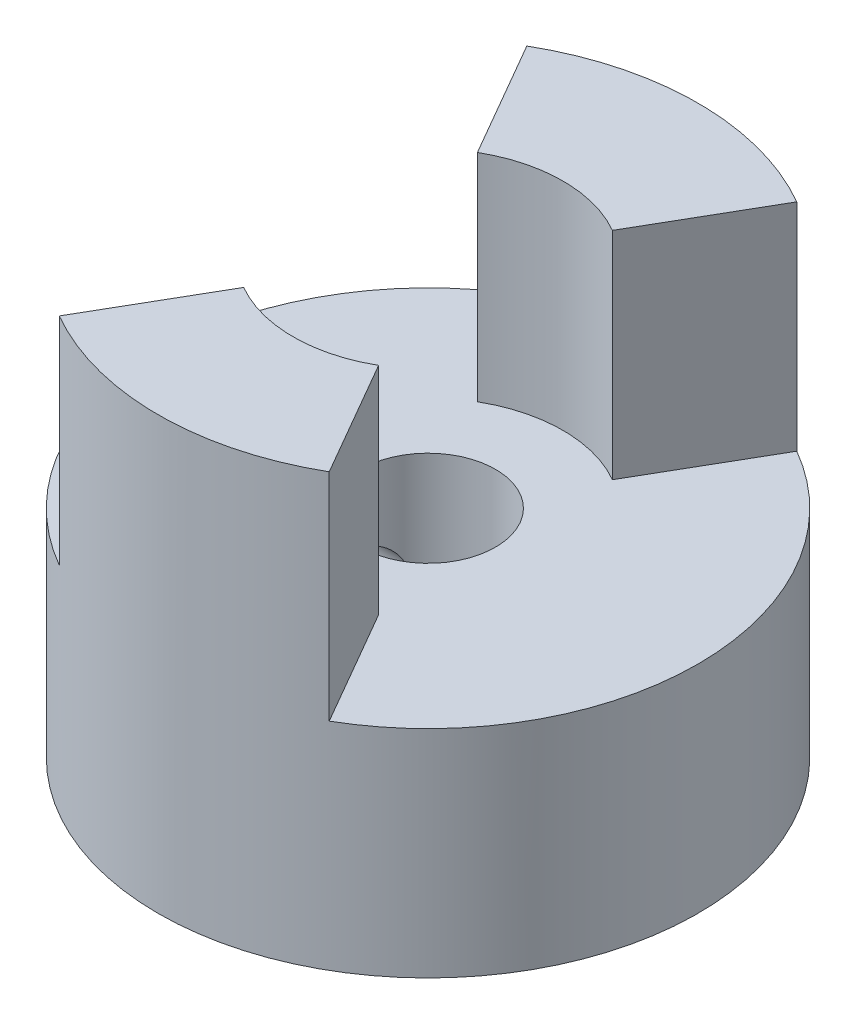
ISO-10303-21;
HEADER;
FILE_DESCRIPTION(('STEP AP214'),'2;1');
FILE_NAME('part.step','',(''),(''),'','','');
FILE_SCHEMA(('AUTOMOTIVE_DESIGN { 1 0 10303 214 1 1 1 1 }'));
ENDSEC;
DATA;
#1=APPLICATION_CONTEXT('core data for automotive mechanical design processes');
#2=APPLICATION_PROTOCOL_DEFINITION('international standard','automotive_design',2000,#1);
#3=PRODUCT_CONTEXT('',#1,'mechanical');
#4=PRODUCT('Part','Part','',(#3));
#5=PRODUCT_RELATED_PRODUCT_CATEGORY('part','',(#4));
#6=PRODUCT_DEFINITION_FORMATION('','',#4);
#7=PRODUCT_DEFINITION_CONTEXT('part definition',#1,'design');
#8=PRODUCT_DEFINITION('design','',#6,#7);
#9=PRODUCT_DEFINITION_SHAPE('','',#8);
#10=(LENGTH_UNIT() NAMED_UNIT(*) SI_UNIT(.MILLI.,.METRE.));
#11=(NAMED_UNIT(*) PLANE_ANGLE_UNIT() SI_UNIT($,.RADIAN.));
#12=(NAMED_UNIT(*) SI_UNIT($,.STERADIAN.) SOLID_ANGLE_UNIT());
#13=UNCERTAINTY_MEASURE_WITH_UNIT(LENGTH_MEASURE(1.E-05),#10,'distance_accuracy_value','');
#14=(GEOMETRIC_REPRESENTATION_CONTEXT(3) GLOBAL_UNCERTAINTY_ASSIGNED_CONTEXT((#13)) GLOBAL_UNIT_ASSIGNED_CONTEXT((#10,
#11,#12)) REPRESENTATION_CONTEXT('',''));
#15=CARTESIAN_POINT('',(0.,0.,0.));
#16=DIRECTION('',(0.,0.,1.));
#17=DIRECTION('',(1.,0.,0.));
#18=AXIS2_PLACEMENT_3D('',#15,#16,#17);
#19=CARTESIAN_POINT('',(0.,10.16,0.));
#20=DIRECTION('',(0.,-1.,0.));
#21=DIRECTION('',(0.,0.,-1.));
#22=AXIS2_PLACEMENT_3D('',#19,#20,#21);
#23=CYLINDRICAL_SURFACE('',#22,6.35);
#24=CARTESIAN_POINT('',(-6.28558851935748,2.54,0.902151298464642));
#25=CARTESIAN_POINT('',(-6.28558930949851,2.49032772069293,0.90214922151933));
#26=CARTESIAN_POINT('',(-6.28619225287237,2.44062567311102,0.897975378967087));
#27=CARTESIAN_POINT('',(-6.28853827720004,2.34260849163608,0.881393080700006));
#28=CARTESIAN_POINT('',(-6.2902825036285,2.29429480211196,0.868976351642361));
#29=CARTESIAN_POINT('',(-6.29471196337785,2.20048744729698,0.836284410783646));
#30=CARTESIAN_POINT('',(-6.29739650963554,2.15499175146994,0.816014935602378));
#31=CARTESIAN_POINT('',(-6.30340687039908,2.06805561150595,0.768205433808864));
#32=CARTESIAN_POINT('',(-6.30673258764374,2.02661455374414,0.740666509687786));
#33=CARTESIAN_POINT('',(-6.31368140709518,1.94866713173239,0.678893494066909));
#34=CARTESIAN_POINT('',(-6.31730623736015,1.91219321346583,0.644618650565194));
#35=CARTESIAN_POINT('',(-6.32443601084304,1.84549623151414,0.570433994980236));
#36=CARTESIAN_POINT('',(-6.32794094773124,1.81527349743435,0.53052388595371));
#37=CARTESIAN_POINT('',(-6.33446054188011,1.76181837511808,0.445994687258361));
#38=CARTESIAN_POINT('',(-6.33747309348638,1.73861566552863,0.401356653100046));
#39=CARTESIAN_POINT('',(-6.34265794372639,1.7000495318179,0.308767899262933));
#40=CARTESIAN_POINT('',(-6.34483028116611,1.68468574563916,0.260817332696702));
#41=CARTESIAN_POINT('',(-6.34808611517873,1.66233138741441,0.163297596386096));
#42=CARTESIAN_POINT('',(-6.34917665164524,1.65528662083121,0.113741088201795));
#43=CARTESIAN_POINT('',(-6.35017951352969,1.64960213401485,0.0141377220658727));
#44=CARTESIAN_POINT('',(-6.35009189638939,1.65096200400566,-0.0359091118606696));
#45=CARTESIAN_POINT('',(-6.34876205070392,1.66200514148729,-0.134703124233849));
#46=CARTESIAN_POINT('',(-6.34752790394927,1.6716301130808,-0.18345694549462));
#47=CARTESIAN_POINT('',(-6.34406201633724,1.69883888925252,-0.27865266882191));
#48=CARTESIAN_POINT('',(-6.34183025255263,1.71642287674484,-0.325094517727449));
#49=CARTESIAN_POINT('',(-6.3366145220809,1.75911119014937,-0.414525745346832));
#50=CARTESIAN_POINT('',(-6.33362807708654,1.78424034592336,-0.457503121429912));
#51=CARTESIAN_POINT('',(-6.32724357962926,1.84128757267097,-0.538653941166115));
#52=CARTESIAN_POINT('',(-6.32384550352816,1.87320603360462,-0.576827108677446));
#53=CARTESIAN_POINT('',(-6.31698945662908,1.94325132515958,-0.647628545434086));
#54=CARTESIAN_POINT('',(-6.31353122210508,1.98142901671788,-0.680206491871437));
#55=CARTESIAN_POINT('',(-6.3069787639118,2.0627354418289,-0.738499853663496));
#56=CARTESIAN_POINT('',(-6.30388454197191,2.10586419890154,-0.764215236415832));
#57=CARTESIAN_POINT('',(-6.29841511394585,2.19589772373991,-0.808058081331826));
#58=CARTESIAN_POINT('',(-6.29604035262133,2.24280480463289,-0.826180852476162));
#59=CARTESIAN_POINT('',(-6.29229021334769,2.33903717874309,-0.854275504100272));
#60=CARTESIAN_POINT('',(-6.29091477444326,2.38836232427056,-0.864247881731272));
#61=CARTESIAN_POINT('',(-6.28933223560538,2.48758431928694,-0.875690381369412));
#62=CARTESIAN_POINT('',(-6.28911536044955,2.53747281475086,-0.877231642427657));
#63=CARTESIAN_POINT('',(-6.28984886834818,2.6367960708403,-0.871956436711648));
#64=CARTESIAN_POINT('',(-6.29079921999532,2.68623084363837,-0.865140194818015));
#65=CARTESIAN_POINT('',(-6.29374993544121,2.78302609918136,-0.843403796466012));
#66=CARTESIAN_POINT('',(-6.29574576034953,2.83039459708842,-0.82851866120804));
#67=CARTESIAN_POINT('',(-6.30055622166778,2.92196459745703,-0.791103634503589));
#68=CARTESIAN_POINT('',(-6.30337089366738,2.96616596216093,-0.768573410770463));
#69=CARTESIAN_POINT('',(-6.30952112311314,3.05046703466814,-0.716335666814462));
#70=CARTESIAN_POINT('',(-6.31285998938919,3.09053780816539,-0.686581848971167));
#71=CARTESIAN_POINT('',(-6.31966685760839,3.1651437303412,-0.620806945944381));
#72=CARTESIAN_POINT('',(-6.32313486587971,3.19967860731085,-0.584785553321109));
#73=CARTESIAN_POINT('',(-6.32983305561446,3.26248547482292,-0.507186430598387));
#74=CARTESIAN_POINT('',(-6.33306134147356,3.29071050079013,-0.465570501490363));
#75=CARTESIAN_POINT('',(-6.33888164227248,3.33977020403631,-0.378148063921846));
#76=CARTESIAN_POINT('',(-6.34147367274605,3.36060506174682,-0.332341657806521));
#77=CARTESIAN_POINT('',(-6.34571365437414,3.39421689874521,-0.237989617191075));
#78=CARTESIAN_POINT('',(-6.34736468434711,3.40702017023049,-0.18945349336628));
#79=CARTESIAN_POINT('',(-6.34954060701276,3.42429068538261,-0.0908963283777614));
#80=CARTESIAN_POINT('',(-6.35006556409996,3.42875840571635,-0.0408753722900821));
#81=CARTESIAN_POINT('',(-6.34992182924384,3.42922051158465,0.05877466012233));
#82=CARTESIAN_POINT('',(-6.34926330037444,3.42528698740904,0.10840343202402));
#83=CARTESIAN_POINT('',(-6.34683734350156,3.40921201034434,0.206284414375948));
#84=CARTESIAN_POINT('',(-6.34506991777634,3.39707057431855,0.254536627654138));
#85=CARTESIAN_POINT('',(-6.34061542393752,3.3649487918609,0.348279604316084));
#86=CARTESIAN_POINT('',(-6.33792886646004,3.3449727971243,0.393771884531274));
#87=CARTESIAN_POINT('',(-6.33192427418014,3.29775650354736,0.480768792458442));
#88=CARTESIAN_POINT('',(-6.32860622426234,3.27051603081832,0.52227332468396));
#89=CARTESIAN_POINT('',(-6.321667144411,3.20928071062304,0.600483925158971));
#90=CARTESIAN_POINT('',(-6.31804385812267,3.17523243517413,0.637147964872379));
#91=CARTESIAN_POINT('',(-6.31091493619968,3.10146015896557,0.704269111552658));
#92=CARTESIAN_POINT('',(-6.30740932846154,3.0617348239905,0.734724755335854));
#93=CARTESIAN_POINT('',(-6.3008891237157,2.97751100980628,0.788695797624822));
#94=CARTESIAN_POINT('',(-6.29787699510575,2.93299027739042,0.812176757048392));
#95=CARTESIAN_POINT('',(-6.2927091701142,2.84061722955361,0.851295523732946));
#96=CARTESIAN_POINT('',(-6.29055256738643,2.79276850334219,0.866941635885582));
#97=CARTESIAN_POINT('',(-6.28784610529185,2.71057544929969,0.886313377691056));
#98=CARTESIAN_POINT('',(-6.28700383725523,2.67674360378122,0.892243750830576));
#99=CARTESIAN_POINT('',(-6.28587477429565,2.60861257068794,0.900163407868339));
#100=CARTESIAN_POINT('',(-6.2855879735316,2.57431338803129,0.90215273320916));
#101=CARTESIAN_POINT('',(-6.28558851935748,2.54,0.902151298464642));
#102=B_SPLINE_CURVE_WITH_KNOTS('',3,(#24,#25,#26,#27,#28,#29,#30,#31,#32,#33,#34,#35,#36,#37,
#38,#39,#40,#41,#42,#43,#44,#45,#46,#47,#48,#49,#50,#51,#52,#53,#54,#55,#56,#57,#58,#59,#60,#61,
#62,#63,#64,#65,#66,#67,#68,#69,#70,#71,#72,#73,#74,#75,#76,#77,#78,#79,#80,#81,#82,#83,#84,#85,
#86,#87,#88,#89,#90,#91,#92,#93,#94,#95,#96,#97,#98,#99,#100,#101),.UNSPECIFIED.,.T.,.F.,(4,2,2,
2,2,2,2,2,2,2,2,2,2,2,2,2,2,2,2,2,2,2,2,2,2,2,2,2,2,2,2,2,2,2,2,2,2,2,4),(0.,0.148891447884245,
0.29793256375092,0.446865006181326,0.595774874347768,0.745615029307906,0.895463082856571,
1.04593607240677,1.1964021114105,1.34588242976206,1.4953554601166,1.64378279773924,
1.79221354669227,1.94113821159557,2.09007143265523,2.24028099713308,2.39049127520736,
2.54079422282647,2.69108800170145,2.84011167111443,2.98913133074124,3.13750932339767,
3.28589376599154,3.43525558073417,3.58462472410346,3.73507112607906,3.88551385464141,
4.03546148805132,4.18540054647161,4.33405816379719,4.48271547570397,4.63129033277961,
4.77986874658787,4.9296625300009,5.07949157583406,5.2300485866754,5.38044566835908,
5.48330029516348,5.58615384038151),.UNSPECIFIED.);
#103=CARTESIAN_POINT('',(-6.28558851935748,2.54,0.902151298464642));
#104=VERTEX_POINT('',#103);
#105=EDGE_CURVE('E107',#104,#104,#102,.T.);
#106=ORIENTED_EDGE('',*,*,#105,.T.);
#107=EDGE_LOOP('',(#106));
#108=FACE_BOUND('',#107,.T.);
#109=CARTESIAN_POINT('',(0.,0.,0.));
#110=DIRECTION('',(0.,1.,0.));
#111=DIRECTION('',(0.,0.,1.));
#112=AXIS2_PLACEMENT_3D('',#109,#110,#111);
#113=CIRCLE('',#112,6.35);
#114=CARTESIAN_POINT('',(0.,0.,6.35));
#115=VERTEX_POINT('',#114);
#116=EDGE_CURVE('E132',#115,#115,#113,.T.);
#117=ORIENTED_EDGE('',*,*,#116,.T.);
#118=EDGE_LOOP('',(#117));
#119=FACE_BOUND('',#118,.T.);
#120=DIRECTION('',(0.,-1.,0.));
#121=VECTOR('',#120,1.);
#122=CARTESIAN_POINT('',(3.17500000000001,10.16,-5.49926131403118));
#123=LINE('',#122,#121);
#124=CARTESIAN_POINT('',(3.17500000000001,5.08,-5.49926131403118));
#125=VERTEX_POINT('',#124);
#126=CARTESIAN_POINT('',(3.17500000000001,10.16,-5.49926131403118));
#127=VERTEX_POINT('',#126);
#128=EDGE_CURVE('E102',#125,#127,#123,.F.);
#129=ORIENTED_EDGE('',*,*,#128,.F.);
#130=CARTESIAN_POINT('',(0.,5.08,0.));
#131=DIRECTION('',(0.,-1.,0.));
#132=DIRECTION('',(0.,0.,-1.));
#133=AXIS2_PLACEMENT_3D('',#130,#131,#132);
#134=CIRCLE('',#133,6.35);
#135=CARTESIAN_POINT('',(3.17500000000002,5.08,5.49926131403118));
#136=VERTEX_POINT('',#135);
#137=EDGE_CURVE('E179',#125,#136,#134,.T.);
#138=ORIENTED_EDGE('',*,*,#137,.T.);
#139=DIRECTION('',(0.,-1.,0.));
#140=VECTOR('',#139,1.);
#141=CARTESIAN_POINT('',(3.17500000000002,10.16,5.49926131403118));
#142=LINE('',#141,#140);
#143=CARTESIAN_POINT('',(3.17500000000002,10.16,5.49926131403118));
#144=VERTEX_POINT('',#143);
#145=EDGE_CURVE('E178',#144,#136,#142,.T.);
#146=ORIENTED_EDGE('',*,*,#145,.F.);
#147=CARTESIAN_POINT('',(0.,10.16,0.));
#148=DIRECTION('',(0.,1.,0.));
#149=DIRECTION('',(0.,0.,1.));
#150=AXIS2_PLACEMENT_3D('',#147,#148,#149);
#151=CIRCLE('',#150,6.35);
#152=CARTESIAN_POINT('',(-3.17500000000002,10.16,5.49926131403118));
#153=VERTEX_POINT('',#152);
#154=EDGE_CURVE('E134',#153,#144,#151,.T.);
#155=ORIENTED_EDGE('',*,*,#154,.F.);
#156=DIRECTION('',(0.,-1.,0.));
#157=VECTOR('',#156,1.);
#158=CARTESIAN_POINT('',(-3.17500000000002,10.16,5.49926131403118));
#159=LINE('',#158,#157);
#160=CARTESIAN_POINT('',(-3.17500000000002,5.08,5.49926131403118));
#161=VERTEX_POINT('',#160);
#162=EDGE_CURVE('E124',#153,#161,#159,.T.);
#163=ORIENTED_EDGE('',*,*,#162,.T.);
#164=CARTESIAN_POINT('',(0.,5.08,0.));
#165=DIRECTION('',(0.,-1.,0.));
#166=DIRECTION('',(0.,0.,-1.));
#167=AXIS2_PLACEMENT_3D('',#164,#165,#166);
#168=CIRCLE('',#167,6.35);
#169=CARTESIAN_POINT('',(-3.17500000000001,5.08,-5.49926131403118));
#170=VERTEX_POINT('',#169);
#171=EDGE_CURVE('E173',#161,#170,#168,.T.);
#172=ORIENTED_EDGE('',*,*,#171,.T.);
#173=DIRECTION('',(0.,-1.,0.));
#174=VECTOR('',#173,1.);
#175=CARTESIAN_POINT('',(-3.17500000000001,10.16,-5.49926131403118));
#176=LINE('',#175,#174);
#177=CARTESIAN_POINT('',(-3.17500000000001,10.16,-5.49926131403118));
#178=VERTEX_POINT('',#177);
#179=EDGE_CURVE('E120',#170,#178,#176,.F.);
#180=ORIENTED_EDGE('',*,*,#179,.T.);
#181=EDGE_CURVE('E138',#127,#178,#151,.T.);
#182=ORIENTED_EDGE('',*,*,#181,.F.);
#183=EDGE_LOOP('',(#129,#138,#146,#155,#163,#172,#180,#182));
#184=FACE_BOUND('',#183,.T.);
#185=ADVANCED_FACE('F34',(#108,#119,#184),#23,.T.);
#186=CARTESIAN_POINT('',(0.,10.16,0.));
#187=DIRECTION('',(0.,1.,0.));
#188=DIRECTION('',(0.,0.,1.));
#189=AXIS2_PLACEMENT_3D('',#186,#187,#188);
#190=PLANE('',#189);
#191=CARTESIAN_POINT('',(0.,10.16,0.));
#192=DIRECTION('',(0.,1.,0.));
#193=DIRECTION('',(0.,0.,1.));
#194=AXIS2_PLACEMENT_3D('',#191,#192,#193);
#195=CIRCLE('',#194,3.175);
#196=CARTESIAN_POINT('',(1.5875,10.16,-2.74963065701559));
#197=VERTEX_POINT('',#196);
#198=CARTESIAN_POINT('',(-1.5875,10.16,-2.74963065701559));
#199=VERTEX_POINT('',#198);
#200=EDGE_CURVE('E112',#197,#199,#195,.T.);
#201=ORIENTED_EDGE('',*,*,#200,.F.);
#202=DIRECTION('',(0.500000000000001,0.,-0.866025403784438));
#203=VECTOR('',#202,1.);
#204=CARTESIAN_POINT('',(7.62000000000001,10.16,-13.1982271536748));
#205=LINE('',#204,#203);
#206=EDGE_CURVE('E97',#197,#127,#205,.T.);
#207=ORIENTED_EDGE('',*,*,#206,.T.);
#208=ORIENTED_EDGE('',*,*,#181,.T.);
#209=DIRECTION('',(-0.500000000000001,0.,-0.866025403784438));
#210=VECTOR('',#209,1.);
#211=CARTESIAN_POINT('',(-7.62000000000001,10.16,-13.1982271536748));
#212=LINE('',#211,#210);
#213=EDGE_CURVE('E118',#199,#178,#212,.T.);
#214=ORIENTED_EDGE('',*,*,#213,.F.);
#215=EDGE_LOOP('',(#201,#207,#208,#214));
#216=FACE_BOUND('',#215,.T.);
#217=ADVANCED_FACE('F116',(#216),#190,.T.);
#218=ORIENTED_EDGE('',*,*,#154,.T.);
#219=DIRECTION('',(-0.500000000000002,0.,-0.866025403784437));
#220=VECTOR('',#219,1.);
#221=CARTESIAN_POINT('',(0.,10.16,0.));
#222=LINE('',#221,#220);
#223=CARTESIAN_POINT('',(1.58750000000001,10.16,2.74963065701559));
#224=VERTEX_POINT('',#223);
#225=EDGE_CURVE('E106',#144,#224,#222,.T.);
#226=ORIENTED_EDGE('',*,*,#225,.T.);
#227=CARTESIAN_POINT('',(-1.58750000000001,10.16,2.74963065701559));
#228=VERTEX_POINT('',#227);
#229=EDGE_CURVE('E119',#228,#224,#195,.T.);
#230=ORIENTED_EDGE('',*,*,#229,.F.);
#231=DIRECTION('',(0.500000000000002,0.,-0.866025403784437));
#232=VECTOR('',#231,1.);
#233=CARTESIAN_POINT('',(0.,10.16,0.));
#234=LINE('',#233,#232);
#235=EDGE_CURVE('E165',#153,#228,#234,.T.);
#236=ORIENTED_EDGE('',*,*,#235,.F.);
#237=EDGE_LOOP('',(#218,#226,#230,#236));
#238=FACE_BOUND('',#237,.T.);
#239=ADVANCED_FACE('F157',(#238),#190,.T.);
#240=CARTESIAN_POINT('',(0.,5.08,0.));
#241=DIRECTION('',(0.,1.,0.));
#242=DIRECTION('',(0.,0.,1.));
#243=AXIS2_PLACEMENT_3D('',#240,#241,#242);
#244=CYLINDRICAL_SURFACE('',#243,3.175);
#245=DIRECTION('',(0.,1.,0.));
#246=VECTOR('',#245,1.);
#247=CARTESIAN_POINT('',(1.5875,5.08,-2.74963065701559));
#248=LINE('',#247,#246);
#249=CARTESIAN_POINT('',(1.5875,5.08,-2.74963065701559));
#250=VERTEX_POINT('',#249);
#251=EDGE_CURVE('E11',#197,#250,#248,.F.);
#252=ORIENTED_EDGE('',*,*,#251,.F.);
#253=ORIENTED_EDGE('',*,*,#200,.T.);
#254=DIRECTION('',(0.,1.,0.));
#255=VECTOR('',#254,1.);
#256=CARTESIAN_POINT('',(-1.5875,5.08,-2.74963065701559));
#257=LINE('',#256,#255);
#258=CARTESIAN_POINT('',(-1.5875,5.08,-2.74963065701559));
#259=VERTEX_POINT('',#258);
#260=EDGE_CURVE('E145',#199,#259,#257,.F.);
#261=ORIENTED_EDGE('',*,*,#260,.T.);
#262=CARTESIAN_POINT('',(0.,5.08,0.));
#263=DIRECTION('',(0.,1.,0.));
#264=DIRECTION('',(0.,0.,1.));
#265=AXIS2_PLACEMENT_3D('',#262,#263,#264);
#266=CIRCLE('',#265,3.175);
#267=EDGE_CURVE('E114',#250,#259,#266,.T.);
#268=ORIENTED_EDGE('',*,*,#267,.F.);
#269=EDGE_LOOP('',(#252,#253,#261,#268));
#270=FACE_BOUND('',#269,.T.);
#271=ADVANCED_FACE('F110',(#270),#244,.F.);
#272=DIRECTION('',(0.,1.,0.));
#273=VECTOR('',#272,1.);
#274=CARTESIAN_POINT('',(1.58750000000001,5.08,2.74963065701559));
#275=LINE('',#274,#273);
#276=CARTESIAN_POINT('',(1.58750000000001,5.08,2.74963065701559));
#277=VERTEX_POINT('',#276);
#278=EDGE_CURVE('E42',#277,#224,#275,.T.);
#279=ORIENTED_EDGE('',*,*,#278,.F.);
#280=CARTESIAN_POINT('',(-1.58750000000001,5.08,2.74963065701559));
#281=VERTEX_POINT('',#280);
#282=EDGE_CURVE('E128',#281,#277,#266,.T.);
#283=ORIENTED_EDGE('',*,*,#282,.F.);
#284=DIRECTION('',(0.,1.,0.));
#285=VECTOR('',#284,1.);
#286=CARTESIAN_POINT('',(-1.58750000000001,5.08,2.74963065701559));
#287=LINE('',#286,#285);
#288=EDGE_CURVE('E137',#281,#228,#287,.T.);
#289=ORIENTED_EDGE('',*,*,#288,.T.);
#290=ORIENTED_EDGE('',*,*,#229,.T.);
#291=EDGE_LOOP('',(#279,#283,#289,#290));
#292=FACE_BOUND('',#291,.T.);
#293=ADVANCED_FACE('F161',(#292),#244,.F.);
#294=CARTESIAN_POINT('',(0.,10.16,0.));
#295=DIRECTION('',(0.,1.,0.));
#296=DIRECTION('',(0.,0.,1.));
#297=AXIS2_PLACEMENT_3D('',#294,#295,#296);
#298=CYLINDRICAL_SURFACE('',#297,1.5875);
#299=CARTESIAN_POINT('',(-1.31336936570595,2.54,0.891749493537919));
#300=CARTESIAN_POINT('',(-1.31337418134314,2.58539809194285,0.891746127434983));
#301=CARTESIAN_POINT('',(-1.31576469631627,2.63083189148963,0.888252673368106));
#302=CARTESIAN_POINT('',(-1.3249466736153,2.72022996351137,0.874491903928463));
#303=CARTESIAN_POINT('',(-1.33174522927513,2.76419174712727,0.864213670135995));
#304=CARTESIAN_POINT('',(-1.34869320855953,2.84917026170935,0.837513342665844));
#305=CARTESIAN_POINT('',(-1.35882099037347,2.89020398333903,0.821130840617161));
#306=CARTESIAN_POINT('',(-1.38125342878367,2.96891943433128,0.782807183905832));
#307=CARTESIAN_POINT('',(-1.39355859101477,3.00660038204606,0.760864737591461));
#308=CARTESIAN_POINT('',(-1.42053240820777,3.08189594619254,0.709347829224739));
#309=CARTESIAN_POINT('',(-1.43531354568921,3.1190874522979,0.679213651023043));
#310=CARTESIAN_POINT('',(-1.46468374459763,3.18822532883692,0.613319025231048));
#311=CARTESIAN_POINT('',(-1.47927268110937,3.2201684293129,0.577555097053345));
#312=CARTESIAN_POINT('',(-1.50818419748537,3.28073496035808,0.497498087406914));
#313=CARTESIAN_POINT('',(-1.52236471519554,3.3088011334185,0.452727128087444));
#314=CARTESIAN_POINT('',(-1.54734165400948,3.35680044913148,0.358153762156145));
#315=CARTESIAN_POINT('',(-1.55814074679858,3.37674001644334,0.30835536910411));
#316=CARTESIAN_POINT('',(-1.57432079923708,3.40611726067132,0.209650027004739));
#317=CARTESIAN_POINT('',(-1.58008647358717,3.41630789698135,0.161031770934024));
#318=CARTESIAN_POINT('',(-1.58703738258298,3.42841600038119,0.0624665300538938));
#319=CARTESIAN_POINT('',(-1.58822624709487,3.43034002385916,0.012520629869948));
#320=CARTESIAN_POINT('',(-1.58602963090688,3.42606091841265,-0.0814570821716255));
#321=CARTESIAN_POINT('',(-1.58312623735326,3.42071651801922,-0.125542863446249));
#322=CARTESIAN_POINT('',(-1.57387186194999,3.40364391957922,-0.212078227612656));
#323=CARTESIAN_POINT('',(-1.56752061352994,3.39191522793189,-0.254527683720369));
#324=CARTESIAN_POINT('',(-1.55185826401913,3.36242648007224,-0.337165339873274));
#325=CARTESIAN_POINT('',(-1.5425183995095,3.34460769230058,-0.377326901733236));
#326=CARTESIAN_POINT('',(-1.52166849875881,3.30357666566777,-0.454167929257324));
#327=CARTESIAN_POINT('',(-1.51015779139803,3.28036275837935,-0.490846312804581));
#328=CARTESIAN_POINT('',(-1.48449097601727,3.22628907314676,-0.564009160802864));
#329=CARTESIAN_POINT('',(-1.47018311674497,3.19486828596499,-0.600025700800062));
#330=CARTESIAN_POINT('',(-1.44124022140758,3.12673800419569,-0.66655992746304));
#331=CARTESIAN_POINT('',(-1.42660484664555,3.09002279858815,-0.69707159504474));
#332=CARTESIAN_POINT('',(-1.39710996062068,3.0082404382485,-0.754571548831487));
#333=CARTESIAN_POINT('',(-1.38235644910231,2.96271394217944,-0.780967296664305));
#334=CARTESIAN_POINT('',(-1.35620561047593,2.86692072883052,-0.825551562427311));
#335=CARTESIAN_POINT('',(-1.34480439983362,2.81665958636597,-0.84374959026947));
#336=CARTESIAN_POINT('',(-1.32806905998932,2.7169347672969,-0.869835366350618));
#337=CARTESIAN_POINT('',(-1.32232210120319,2.66772970103271,-0.878432220840307));
#338=CARTESIAN_POINT('',(-1.316462877088,2.56826669884082,-0.887194813763925));
#339=CARTESIAN_POINT('',(-1.31634348480786,2.51801017526296,-0.887371216162536));
#340=CARTESIAN_POINT('',(-1.32131730243462,2.42617365117324,-0.879935666036968));
#341=CARTESIAN_POINT('',(-1.32561405670199,2.38444483328481,-0.873513776059056));
#342=CARTESIAN_POINT('',(-1.3376342524036,2.30278039494887,-0.85499235469702));
#343=CARTESIAN_POINT('',(-1.34535931205142,2.26284563113719,-0.842890141956378));
#344=CARTESIAN_POINT('',(-1.36370053985171,2.18400414514017,-0.812893665851482));
#345=CARTESIAN_POINT('',(-1.37442101493431,2.14520435114177,-0.794784912836595));
#346=CARTESIAN_POINT('',(-1.39749819275672,2.07095771411083,-0.75346858908389));
#347=CARTESIAN_POINT('',(-1.40985568315316,2.0355124993125,-0.730258560280335));
#348=CARTESIAN_POINT('',(-1.4372584135161,1.96283198553908,-0.674941786448972));
#349=CARTESIAN_POINT('',(-1.45241010843676,1.92627052107099,-0.641998456335548));
#350=CARTESIAN_POINT('',(-1.48200962824345,1.85890814703018,-0.570357025187911));
#351=CARTESIAN_POINT('',(-1.49645699566818,1.82811094543776,-0.531655248446349));
#352=CARTESIAN_POINT('',(-1.5240119015807,1.77152013950714,-0.446812077993524));
#353=CARTESIAN_POINT('',(-1.53699770086395,1.74610732032993,-0.400373975000445));
#354=CARTESIAN_POINT('',(-1.55912149562473,1.70372018440084,-0.302954498015872));
#355=CARTESIAN_POINT('',(-1.5682635971317,1.68673685932305,-0.251978043045064));
#356=CARTESIAN_POINT('',(-1.5808588586064,1.66344831917314,-0.15259840239677));
#357=CARTESIAN_POINT('',(-1.58480247117687,1.65622064240959,-0.10447407327978));
#358=CARTESIAN_POINT('',(-1.58822089110122,1.64974295982994,-0.00754265874221396));
#359=CARTESIAN_POINT('',(-1.58769825144436,1.65048839650162,0.0412640207064533));
#360=CARTESIAN_POINT('',(-1.5825045302488,1.65945051576541,0.133261167255948));
#361=CARTESIAN_POINT('',(-1.57822999482566,1.66695477563105,0.17654663705213));
#362=CARTESIAN_POINT('',(-1.56645888258453,1.68809790782054,0.261125459958501));
#363=CARTESIAN_POINT('',(-1.5589619344624,1.70173748709809,0.30241858288947));
#364=CARTESIAN_POINT('',(-1.54109127539252,1.73514231092476,0.383363358154099));
#365=CARTESIAN_POINT('',(-1.53063382277286,1.75508821220608,0.422921335496884));
#366=CARTESIAN_POINT('',(-1.50779949737244,1.80031025822913,0.498245295125563));
#367=CARTESIAN_POINT('',(-1.49542188529833,1.82558845734864,0.534009807896814));
#368=CARTESIAN_POINT('',(-1.46816451093531,1.88415434627165,0.605199727319031));
#369=CARTESIAN_POINT('',(-1.45316163689605,1.91803416677846,0.640091461588145));
#370=CARTESIAN_POINT('',(-1.42331490580598,1.99110125895089,0.703972415521912));
#371=CARTESIAN_POINT('',(-1.40847127578143,2.03029523964418,0.73295405608366));
#372=CARTESIAN_POINT('',(-1.37946739028274,2.11644874292521,0.786265354628386));
#373=CARTESIAN_POINT('',(-1.36543948916231,2.163768629602,0.810090507922152));
#374=CARTESIAN_POINT('',(-1.34151796133711,2.26274095179182,0.849128073692581));
#375=CARTESIAN_POINT('',(-1.3316114853602,2.31437930972669,0.864367307734988));
#376=CARTESIAN_POINT('',(-1.3209989834458,2.39557645428247,0.880431447891016));
#377=CARTESIAN_POINT('',(-1.31815679054345,2.42421769573951,0.884664082167362));
#378=CARTESIAN_POINT('',(-1.31434051710581,2.48190110422093,0.890324067277493));
#379=CARTESIAN_POINT('',(-1.31336628348781,2.51094323819495,0.891751647990828));
#380=CARTESIAN_POINT('',(-1.31336936570595,2.54,0.891749493537919));
#381=B_SPLINE_CURVE_WITH_KNOTS('',3,(#299,#300,#301,#302,#303,#304,#305,#306,#307,#308,#309,
#310,#311,#312,#313,#314,#315,#316,#317,#318,#319,#320,#321,#322,#323,#324,#325,#326,#327,#328,
#329,#330,#331,#332,#333,#334,#335,#336,#337,#338,#339,#340,#341,#342,#343,#344,#345,#346,#347,
#348,#349,#350,#351,#352,#353,#354,#355,#356,#357,#358,#359,#360,#361,#362,#363,#364,#365,#366,
#367,#368,#369,#370,#371,#372,#373,#374,#375,#376,#377,#378,#379,#380),.UNSPECIFIED.,.T.,.F.,(4,
2,2,2,2,2,2,2,2,2,2,2,2,2,2,2,2,2,2,2,2,2,2,2,2,2,2,2,2,2,2,2,2,2,2,2,2,2,2,2,4),(0.,
0.136070558616257,0.272360624608927,0.407781693553982,0.543234251570788,0.692921428135663,
0.842701514774207,1.00595764877156,1.16908446566248,1.31824528036013,1.46728777127072,
1.60016722134327,1.73305694643543,1.86726618893516,2.00151699066493,2.15058055929454,
2.29980614063187,2.46292540711907,2.62585495377098,2.77573358853013,2.92542240652997,
3.05215902539942,3.17895552966048,3.31088102822438,3.44287023541548,3.5966935661395,
3.75061550933125,3.91322986076644,4.07567005534719,4.2213156711567,4.36687803891152,
4.49868986763744,4.63051688852126,4.76652732223408,4.90259025279234,5.0546414118758,
5.2068863518285,5.37042387150968,5.5334476424895,5.62054588165134,5.70763698264674),.UNSPECIFIED.);
#382=CARTESIAN_POINT('',(-1.31336936570595,2.54,0.891749493537919));
#383=VERTEX_POINT('',#382);
#384=EDGE_CURVE('E192',#383,#383,#381,.T.);
#385=ORIENTED_EDGE('',*,*,#384,.T.);
#386=EDGE_LOOP('',(#385));
#387=FACE_BOUND('',#386,.T.);
#388=CARTESIAN_POINT('',(0.,0.,0.));
#389=DIRECTION('',(0.,1.,0.));
#390=DIRECTION('',(0.,0.,1.));
#391=AXIS2_PLACEMENT_3D('',#388,#389,#390);
#392=CIRCLE('',#391,1.5875);
#393=CARTESIAN_POINT('',(0.,0.,1.5875));
#394=VERTEX_POINT('',#393);
#395=EDGE_CURVE('E129',#394,#394,#392,.T.);
#396=ORIENTED_EDGE('',*,*,#395,.F.);
#397=EDGE_LOOP('',(#396));
#398=FACE_BOUND('',#397,.T.);
#399=CARTESIAN_POINT('',(0.,5.08,0.));
#400=DIRECTION('',(0.,1.,0.));
#401=DIRECTION('',(0.,0.,1.));
#402=AXIS2_PLACEMENT_3D('',#399,#400,#401);
#403=CIRCLE('',#402,1.5875);
#404=CARTESIAN_POINT('',(0.,5.08,1.5875));
#405=VERTEX_POINT('',#404);
#406=EDGE_CURVE('E133',#405,#405,#403,.F.);
#407=ORIENTED_EDGE('',*,*,#406,.F.);
#408=EDGE_LOOP('',(#407));
#409=FACE_BOUND('',#408,.T.);
#410=ADVANCED_FACE('F220',(#387,#398,#409),#298,.F.);
#411=CARTESIAN_POINT('',(0.,0.,0.));
#412=DIRECTION('',(0.,1.,0.));
#413=DIRECTION('',(0.,0.,1.));
#414=AXIS2_PLACEMENT_3D('',#411,#412,#413);
#415=PLANE('',#414);
#416=ORIENTED_EDGE('',*,*,#395,.T.);
#417=EDGE_LOOP('',(#416));
#418=FACE_BOUND('',#417,.T.);
#419=ORIENTED_EDGE('',*,*,#116,.F.);
#420=EDGE_LOOP('',(#419));
#421=FACE_BOUND('',#420,.T.);
#422=ADVANCED_FACE('F217',(#418,#421),#415,.F.);
#423=CARTESIAN_POINT('',(0.,5.08,0.));
#424=DIRECTION('',(0.,1.,0.));
#425=DIRECTION('',(0.,0.,1.));
#426=AXIS2_PLACEMENT_3D('',#423,#424,#425);
#427=PLANE('',#426);
#428=DIRECTION('',(0.500000000000001,0.,-0.866025403784438));
#429=VECTOR('',#428,1.);
#430=CARTESIAN_POINT('',(7.62000000000001,5.08,-13.1982271536748));
#431=LINE('',#430,#429);
#432=EDGE_CURVE('E49',#250,#125,#431,.T.);
#433=ORIENTED_EDGE('',*,*,#432,.F.);
#434=ORIENTED_EDGE('',*,*,#267,.T.);
#435=DIRECTION('',(-0.500000000000001,0.,-0.866025403784438));
#436=VECTOR('',#435,1.);
#437=CARTESIAN_POINT('',(-7.62000000000001,5.08,-13.1982271536748));
#438=LINE('',#437,#436);
#439=EDGE_CURVE('E166',#259,#170,#438,.T.);
#440=ORIENTED_EDGE('',*,*,#439,.T.);
#441=ORIENTED_EDGE('',*,*,#171,.F.);
#442=DIRECTION('',(0.500000000000002,0.,-0.866025403784437));
#443=VECTOR('',#442,1.);
#444=CARTESIAN_POINT('',(0.,5.08,0.));
#445=LINE('',#444,#443);
#446=EDGE_CURVE('E55',#161,#281,#445,.T.);
#447=ORIENTED_EDGE('',*,*,#446,.T.);
#448=ORIENTED_EDGE('',*,*,#282,.T.);
#449=DIRECTION('',(-0.500000000000002,0.,-0.866025403784437));
#450=VECTOR('',#449,1.);
#451=CARTESIAN_POINT('',(0.,5.08,0.));
#452=LINE('',#451,#450);
#453=EDGE_CURVE('E152',#136,#277,#452,.T.);
#454=ORIENTED_EDGE('',*,*,#453,.F.);
#455=ORIENTED_EDGE('',*,*,#137,.F.);
#456=EDGE_LOOP('',(#433,#434,#440,#441,#447,#448,#454,#455));
#457=FACE_BOUND('',#456,.T.);
#458=ORIENTED_EDGE('',*,*,#406,.T.);
#459=EDGE_LOOP('',(#458));
#460=FACE_BOUND('',#459,.T.);
#461=ADVANCED_FACE('F213',(#457,#460),#427,.T.);
#462=CARTESIAN_POINT('',(-7.62000000000001,5.08,-13.1982271536748));
#463=DIRECTION('',(0.866025403784438,0.,-0.500000000000001));
#464=DIRECTION('',(-0.500000000000001,0.,-0.866025403784438));
#465=AXIS2_PLACEMENT_3D('',#462,#463,#464);
#466=PLANE('',#465);
#467=ORIENTED_EDGE('',*,*,#439,.F.);
#468=ORIENTED_EDGE('',*,*,#260,.F.);
#469=ORIENTED_EDGE('',*,*,#213,.T.);
#470=ORIENTED_EDGE('',*,*,#179,.F.);
#471=EDGE_LOOP('',(#467,#468,#469,#470));
#472=FACE_BOUND('',#471,.T.);
#473=ADVANCED_FACE('F210',(#472),#466,.F.);
#474=CARTESIAN_POINT('',(0.,5.08,0.));
#475=DIRECTION('',(0.866025403784437,0.,0.500000000000002));
#476=DIRECTION('',(0.500000000000002,0.,-0.866025403784437));
#477=AXIS2_PLACEMENT_3D('',#474,#475,#476);
#478=PLANE('',#477);
#479=ORIENTED_EDGE('',*,*,#235,.T.);
#480=ORIENTED_EDGE('',*,*,#288,.F.);
#481=ORIENTED_EDGE('',*,*,#446,.F.);
#482=ORIENTED_EDGE('',*,*,#162,.F.);
#483=EDGE_LOOP('',(#479,#480,#481,#482));
#484=FACE_BOUND('',#483,.T.);
#485=ADVANCED_FACE('F163',(#484),#478,.F.);
#486=CARTESIAN_POINT('',(7.62000000000001,5.08,-13.1982271536748));
#487=DIRECTION('',(0.866025403784438,0.,0.500000000000001));
#488=DIRECTION('',(0.500000000000001,0.,-0.866025403784438));
#489=AXIS2_PLACEMENT_3D('',#486,#487,#488);
#490=PLANE('',#489);
#491=ORIENTED_EDGE('',*,*,#128,.T.);
#492=ORIENTED_EDGE('',*,*,#206,.F.);
#493=ORIENTED_EDGE('',*,*,#251,.T.);
#494=ORIENTED_EDGE('',*,*,#432,.T.);
#495=EDGE_LOOP('',(#491,#492,#493,#494));
#496=FACE_BOUND('',#495,.T.);
#497=ADVANCED_FACE('F99',(#496),#490,.T.);
#498=CARTESIAN_POINT('',(0.,5.08,0.));
#499=DIRECTION('',(0.866025403784437,0.,-0.500000000000002));
#500=DIRECTION('',(-0.500000000000002,0.,-0.866025403784437));
#501=AXIS2_PLACEMENT_3D('',#498,#499,#500);
#502=PLANE('',#501);
#503=ORIENTED_EDGE('',*,*,#145,.T.);
#504=ORIENTED_EDGE('',*,*,#453,.T.);
#505=ORIENTED_EDGE('',*,*,#278,.T.);
#506=ORIENTED_EDGE('',*,*,#225,.F.);
#507=EDGE_LOOP('',(#503,#504,#505,#506));
#508=FACE_BOUND('',#507,.T.);
#509=ADVANCED_FACE('F149',(#508),#502,.T.);
#510=CARTESIAN_POINT('',(-6.34998610497958,2.54,0.0132840719023562));
#511=DIRECTION('',(-0.999997811807807,0.,0.00209197982714333));
#512=DIRECTION('',(0.00209197982714333,0.,0.999997811807807));
#513=AXIS2_PLACEMENT_3D('',#510,#511,#512);
#514=CYLINDRICAL_SURFACE('',#513,0.888999999999999);
#515=ORIENTED_EDGE('',*,*,#384,.F.);
#516=EDGE_LOOP('',(#515));
#517=FACE_BOUND('',#516,.T.);
#518=ORIENTED_EDGE('',*,*,#105,.F.);
#519=EDGE_LOOP('',(#518));
#520=FACE_BOUND('',#519,.T.);
#521=ADVANCED_FACE('F197',(#517,#520),#514,.F.);
#522=CLOSED_SHELL('',(#185,#217,#239,#271,#293,#410,#422,#461,#473,#485,#497,#509,#521));
#523=MANIFOLD_SOLID_BREP('B2',#522);
#524=ADVANCED_BREP_SHAPE_REPRESENTATION('',(#18,#523),#14);
#525=SHAPE_DEFINITION_REPRESENTATION(#9,#524);
ENDSEC;
END-ISO-10303-21;
